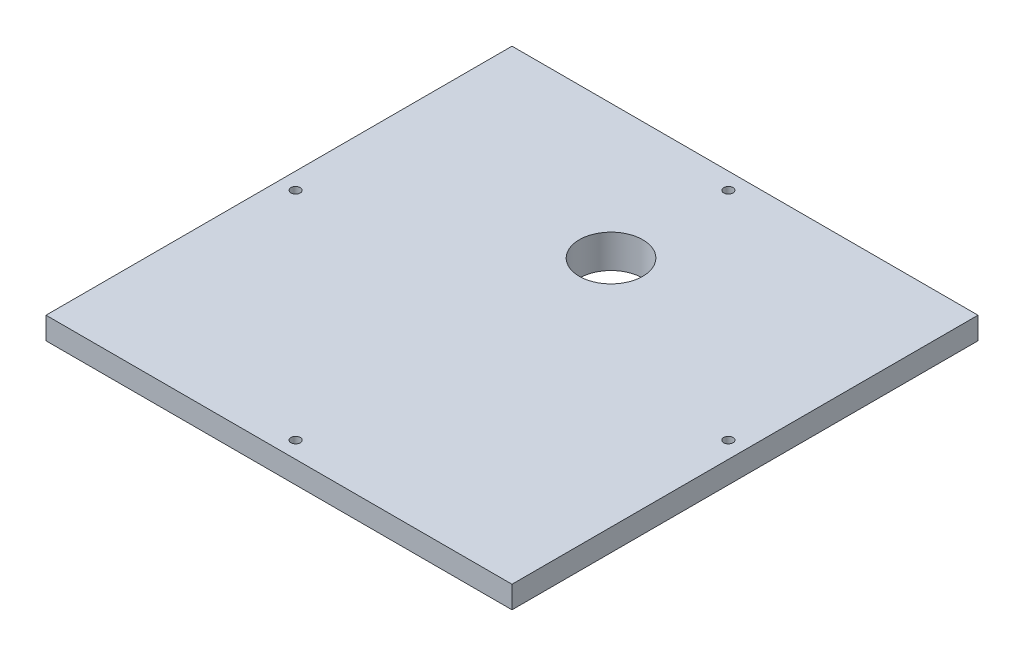
ISO-10303-21;
HEADER;
FILE_DESCRIPTION(('STEP AP214'),'2;1');
FILE_NAME('part.step','',(''),(''),'','','');
FILE_SCHEMA(('AUTOMOTIVE_DESIGN { 1 0 10303 214 1 1 1 1 }'));
ENDSEC;
DATA;
#1=APPLICATION_CONTEXT('core data for automotive mechanical design processes');
#2=APPLICATION_PROTOCOL_DEFINITION('international standard','automotive_design',2000,#1);
#3=PRODUCT_CONTEXT('',#1,'mechanical');
#4=PRODUCT('Part','Part','',(#3));
#5=PRODUCT_RELATED_PRODUCT_CATEGORY('part','',(#4));
#6=PRODUCT_DEFINITION_FORMATION('','',#4);
#7=PRODUCT_DEFINITION_CONTEXT('part definition',#1,'design');
#8=PRODUCT_DEFINITION('design','',#6,#7);
#9=PRODUCT_DEFINITION_SHAPE('','',#8);
#10=(LENGTH_UNIT() NAMED_UNIT(*) SI_UNIT(.MILLI.,.METRE.));
#11=(NAMED_UNIT(*) PLANE_ANGLE_UNIT() SI_UNIT($,.RADIAN.));
#12=(NAMED_UNIT(*) SI_UNIT($,.STERADIAN.) SOLID_ANGLE_UNIT());
#13=UNCERTAINTY_MEASURE_WITH_UNIT(LENGTH_MEASURE(1.E-05),#10,'distance_accuracy_value','');
#14=(GEOMETRIC_REPRESENTATION_CONTEXT(3) GLOBAL_UNCERTAINTY_ASSIGNED_CONTEXT((#13)) GLOBAL_UNIT_ASSIGNED_CONTEXT((#10,
#11,#12)) REPRESENTATION_CONTEXT('',''));
#15=CARTESIAN_POINT('',(0.,0.,0.));
#16=DIRECTION('',(0.,0.,1.));
#17=DIRECTION('',(1.,0.,0.));
#18=AXIS2_PLACEMENT_3D('',#15,#16,#17);
#19=CARTESIAN_POINT('',(0.,10.,0.));
#20=DIRECTION('',(0.,-1.,0.));
#21=DIRECTION('',(0.,0.,-1.));
#22=AXIS2_PLACEMENT_3D('',#19,#20,#21);
#23=PLANE('',#22);
#24=CARTESIAN_POINT('',(-97.5,10.,0.));
#25=DIRECTION('',(0.,1.,0.));
#26=DIRECTION('',(0.,0.,1.));
#27=AXIS2_PLACEMENT_3D('',#24,#25,#26);
#28=CIRCLE('',#27,2.1);
#29=CARTESIAN_POINT('',(-97.5,10.,2.1));
#30=VERTEX_POINT('',#29);
#31=EDGE_CURVE('E361',#30,#30,#28,.T.);
#32=ORIENTED_EDGE('',*,*,#31,.F.);
#33=EDGE_LOOP('',(#32));
#34=FACE_BOUND('',#33,.T.);
#35=CARTESIAN_POINT('',(0.,10.,97.5));
#36=DIRECTION('',(0.,1.,0.));
#37=DIRECTION('',(0.,0.,1.));
#38=AXIS2_PLACEMENT_3D('',#35,#36,#37);
#39=CIRCLE('',#38,2.1);
#40=CARTESIAN_POINT('',(0.,10.,99.6));
#41=VERTEX_POINT('',#40);
#42=EDGE_CURVE('E369',#41,#41,#39,.F.);
#43=ORIENTED_EDGE('',*,*,#42,.T.);
#44=EDGE_LOOP('',(#43));
#45=FACE_BOUND('',#44,.T.);
#46=CARTESIAN_POINT('',(97.5,10.,-8.88178419700125E-13));
#47=DIRECTION('',(0.,1.,0.));
#48=DIRECTION('',(0.,0.,1.));
#49=AXIS2_PLACEMENT_3D('',#46,#47,#48);
#50=CIRCLE('',#49,2.09999999999987);
#51=CARTESIAN_POINT('',(97.5,10.,2.09999999999899));
#52=VERTEX_POINT('',#51);
#53=EDGE_CURVE('E377',#52,#52,#50,.F.);
#54=ORIENTED_EDGE('',*,*,#53,.T.);
#55=EDGE_LOOP('',(#54));
#56=FACE_BOUND('',#55,.T.);
#57=CARTESIAN_POINT('',(0.,10.,-44.6253961525413));
#58=DIRECTION('',(0.,1.,0.));
#59=DIRECTION('',(0.,0.,1.));
#60=AXIS2_PLACEMENT_3D('',#57,#58,#59);
#61=CIRCLE('',#60,14.3);
#62=CARTESIAN_POINT('',(0.,10.,-30.3253961525413));
#63=VERTEX_POINT('',#62);
#64=EDGE_CURVE('E351',#63,#63,#61,.T.);
#65=ORIENTED_EDGE('',*,*,#64,.F.);
#66=EDGE_LOOP('',(#65));
#67=FACE_BOUND('',#66,.T.);
#68=DIRECTION('',(0.,0.,-1.));
#69=VECTOR('',#68,1.);
#70=CARTESIAN_POINT('',(105.,10.,105.));
#71=LINE('',#70,#69);
#72=CARTESIAN_POINT('',(105.,10.,105.));
#73=VERTEX_POINT('',#72);
#74=CARTESIAN_POINT('',(105.,10.,-105.));
#75=VERTEX_POINT('',#74);
#76=EDGE_CURVE('E146',#73,#75,#71,.T.);
#77=ORIENTED_EDGE('',*,*,#76,.T.);
#78=DIRECTION('',(-1.,0.,0.));
#79=VECTOR('',#78,1.);
#80=CARTESIAN_POINT('',(-105.,10.,-105.));
#81=LINE('',#80,#79);
#82=CARTESIAN_POINT('',(-105.,10.,-105.));
#83=VERTEX_POINT('',#82);
#84=EDGE_CURVE('E134',#75,#83,#81,.T.);
#85=ORIENTED_EDGE('',*,*,#84,.T.);
#86=DIRECTION('',(0.,0.,1.));
#87=VECTOR('',#86,1.);
#88=CARTESIAN_POINT('',(-105.,10.,105.));
#89=LINE('',#88,#87);
#90=CARTESIAN_POINT('',(-105.,10.,105.));
#91=VERTEX_POINT('',#90);
#92=EDGE_CURVE('E145',#83,#91,#89,.T.);
#93=ORIENTED_EDGE('',*,*,#92,.T.);
#94=DIRECTION('',(1.,0.,0.));
#95=VECTOR('',#94,1.);
#96=CARTESIAN_POINT('',(-105.,10.,105.));
#97=LINE('',#96,#95);
#98=EDGE_CURVE('E151',#91,#73,#97,.T.);
#99=ORIENTED_EDGE('',*,*,#98,.T.);
#100=EDGE_LOOP('',(#77,#85,#93,#99));
#101=FACE_BOUND('',#100,.T.);
#102=CARTESIAN_POINT('',(0.,10.,-97.5));
#103=DIRECTION('',(0.,1.,0.));
#104=DIRECTION('',(0.,0.,1.));
#105=AXIS2_PLACEMENT_3D('',#102,#103,#104);
#106=CIRCLE('',#105,2.1);
#107=CARTESIAN_POINT('',(0.,10.,-95.4));
#108=VERTEX_POINT('',#107);
#109=EDGE_CURVE('E345',#108,#108,#106,.T.);
#110=ORIENTED_EDGE('',*,*,#109,.F.);
#111=EDGE_LOOP('',(#110));
#112=FACE_BOUND('',#111,.T.);
#113=ADVANCED_FACE('F45',(#34,#45,#56,#67,#101,#112),#23,.F.);
#114=CARTESIAN_POINT('',(0.,0.,0.));
#115=DIRECTION('',(0.,-1.,0.));
#116=DIRECTION('',(0.,0.,-1.));
#117=AXIS2_PLACEMENT_3D('',#114,#115,#116);
#118=PLANE('',#117);
#119=CARTESIAN_POINT('',(0.,0.,97.5));
#120=DIRECTION('',(0.,-1.,0.));
#121=DIRECTION('',(0.,0.,-1.));
#122=AXIS2_PLACEMENT_3D('',#119,#120,#121);
#123=CIRCLE('',#122,2.1);
#124=CARTESIAN_POINT('',(0.,0.,95.4));
#125=VERTEX_POINT('',#124);
#126=EDGE_CURVE('E365',#125,#125,#123,.T.);
#127=ORIENTED_EDGE('',*,*,#126,.F.);
#128=EDGE_LOOP('',(#127));
#129=FACE_BOUND('',#128,.T.);
#130=CARTESIAN_POINT('',(97.5,0.,-8.88178419700125E-13));
#131=DIRECTION('',(0.,-1.,0.));
#132=DIRECTION('',(0.,0.,-1.));
#133=AXIS2_PLACEMENT_3D('',#130,#131,#132);
#134=CIRCLE('',#133,2.09999999999987);
#135=CARTESIAN_POINT('',(97.5,0.,-2.10000000000076));
#136=VERTEX_POINT('',#135);
#137=EDGE_CURVE('E373',#136,#136,#134,.T.);
#138=ORIENTED_EDGE('',*,*,#137,.F.);
#139=EDGE_LOOP('',(#138));
#140=FACE_BOUND('',#139,.T.);
#141=DIRECTION('',(0.,0.,1.));
#142=VECTOR('',#141,1.);
#143=CARTESIAN_POINT('',(89.8,0.,-89.8));
#144=LINE('',#143,#142);
#145=CARTESIAN_POINT('',(89.8,0.,-84.8030458649045));
#146=VERTEX_POINT('',#145);
#147=CARTESIAN_POINT('',(89.8,0.,84.8030458649045));
#148=VERTEX_POINT('',#147);
#149=EDGE_CURVE('E219',#146,#148,#144,.T.);
#150=ORIENTED_EDGE('',*,*,#149,.F.);
#151=CARTESIAN_POINT('',(84.7969522785059,0.,-84.7969522785059));
#152=DIRECTION('',(0.,-1.,0.));
#153=DIRECTION('',(0.707106781186548,0.,-0.707106781186548));
#154=AXIS2_PLACEMENT_3D('',#151,#152,#153);
#155=ELLIPSE('',#154,5.00609358752858,5.);
#156=CARTESIAN_POINT('',(84.8030458649045,0.,-89.8));
#157=VERTEX_POINT('',#156);
#158=EDGE_CURVE('E210',#146,#157,#155,.F.);
#159=ORIENTED_EDGE('',*,*,#158,.T.);
#160=DIRECTION('',(1.,0.,0.));
#161=VECTOR('',#160,1.);
#162=CARTESIAN_POINT('',(-89.8,0.,-89.8));
#163=LINE('',#162,#161);
#164=CARTESIAN_POINT('',(-84.8030458649045,0.,-89.8));
#165=VERTEX_POINT('',#164);
#166=EDGE_CURVE('E217',#165,#157,#163,.T.);
#167=ORIENTED_EDGE('',*,*,#166,.F.);
#168=CARTESIAN_POINT('',(-84.7969522785059,0.,-84.7969522785059));
#169=DIRECTION('',(0.,-1.,0.));
#170=DIRECTION('',(-0.707106781186548,0.,-0.707106781186548));
#171=AXIS2_PLACEMENT_3D('',#168,#169,#170);
#172=ELLIPSE('',#171,5.00609358752858,5.);
#173=CARTESIAN_POINT('',(-89.8,0.,-84.8030458649045));
#174=VERTEX_POINT('',#173);
#175=EDGE_CURVE('E54',#165,#174,#172,.F.);
#176=ORIENTED_EDGE('',*,*,#175,.T.);
#177=DIRECTION('',(0.,0.,-1.));
#178=VECTOR('',#177,1.);
#179=CARTESIAN_POINT('',(-89.8,0.,-89.8));
#180=LINE('',#179,#178);
#181=CARTESIAN_POINT('',(-89.8,0.,84.8030458649045));
#182=VERTEX_POINT('',#181);
#183=EDGE_CURVE('E230',#182,#174,#180,.T.);
#184=ORIENTED_EDGE('',*,*,#183,.F.);
#185=CARTESIAN_POINT('',(-84.7969522785059,0.,84.7969522785059));
#186=DIRECTION('',(0.,-1.,0.));
#187=DIRECTION('',(-0.707106781186548,0.,0.707106781186548));
#188=AXIS2_PLACEMENT_3D('',#185,#186,#187);
#189=ELLIPSE('',#188,5.00609358752858,5.);
#190=CARTESIAN_POINT('',(-84.8030458649045,0.,89.8));
#191=VERTEX_POINT('',#190);
#192=EDGE_CURVE('E11',#182,#191,#189,.F.);
#193=ORIENTED_EDGE('',*,*,#192,.T.);
#194=DIRECTION('',(-1.,0.,0.));
#195=VECTOR('',#194,1.);
#196=CARTESIAN_POINT('',(-89.8,0.,89.8));
#197=LINE('',#196,#195);
#198=CARTESIAN_POINT('',(84.8030458649045,0.,89.8));
#199=VERTEX_POINT('',#198);
#200=EDGE_CURVE('E389',#199,#191,#197,.T.);
#201=ORIENTED_EDGE('',*,*,#200,.F.);
#202=CARTESIAN_POINT('',(84.7969522785059,0.,84.7969522785059));
#203=DIRECTION('',(0.,-1.,0.));
#204=DIRECTION('',(0.707106781186548,0.,0.707106781186548));
#205=AXIS2_PLACEMENT_3D('',#202,#203,#204);
#206=ELLIPSE('',#205,5.00609358752858,5.);
#207=EDGE_CURVE('E207',#199,#148,#206,.F.);
#208=ORIENTED_EDGE('',*,*,#207,.T.);
#209=EDGE_LOOP('',(#150,#159,#167,#176,#184,#193,#201,#208));
#210=FACE_BOUND('',#209,.T.);
#211=DIRECTION('',(0.,0.,-1.));
#212=VECTOR('',#211,1.);
#213=CARTESIAN_POINT('',(105.,0.,105.));
#214=LINE('',#213,#212);
#215=CARTESIAN_POINT('',(105.,0.,105.));
#216=VERTEX_POINT('',#215);
#217=CARTESIAN_POINT('',(105.,0.,-105.));
#218=VERTEX_POINT('',#217);
#219=EDGE_CURVE('E160',#216,#218,#214,.T.);
#220=ORIENTED_EDGE('',*,*,#219,.F.);
#221=DIRECTION('',(1.,0.,0.));
#222=VECTOR('',#221,1.);
#223=CARTESIAN_POINT('',(-105.,0.,105.));
#224=LINE('',#223,#222);
#225=CARTESIAN_POINT('',(-105.,0.,105.));
#226=VERTEX_POINT('',#225);
#227=EDGE_CURVE('E156',#226,#216,#224,.T.);
#228=ORIENTED_EDGE('',*,*,#227,.F.);
#229=DIRECTION('',(0.,0.,1.));
#230=VECTOR('',#229,1.);
#231=CARTESIAN_POINT('',(-105.,0.,105.));
#232=LINE('',#231,#230);
#233=CARTESIAN_POINT('',(-105.,0.,-105.));
#234=VERTEX_POINT('',#233);
#235=EDGE_CURVE('E267',#234,#226,#232,.T.);
#236=ORIENTED_EDGE('',*,*,#235,.F.);
#237=DIRECTION('',(-1.,0.,0.));
#238=VECTOR('',#237,1.);
#239=CARTESIAN_POINT('',(-105.,0.,-105.));
#240=LINE('',#239,#238);
#241=EDGE_CURVE('E264',#218,#234,#240,.T.);
#242=ORIENTED_EDGE('',*,*,#241,.F.);
#243=EDGE_LOOP('',(#220,#228,#236,#242));
#244=FACE_BOUND('',#243,.T.);
#245=CARTESIAN_POINT('',(-97.5,0.,0.));
#246=DIRECTION('',(0.,-1.,0.));
#247=DIRECTION('',(0.,0.,-1.));
#248=AXIS2_PLACEMENT_3D('',#245,#246,#247);
#249=CIRCLE('',#248,2.1);
#250=CARTESIAN_POINT('',(-97.5,0.,-2.1));
#251=VERTEX_POINT('',#250);
#252=EDGE_CURVE('E358',#251,#251,#249,.F.);
#253=ORIENTED_EDGE('',*,*,#252,.T.);
#254=EDGE_LOOP('',(#253));
#255=FACE_BOUND('',#254,.T.);
#256=CARTESIAN_POINT('',(0.,0.,-97.5));
#257=DIRECTION('',(0.,-1.,0.));
#258=DIRECTION('',(0.,0.,-1.));
#259=AXIS2_PLACEMENT_3D('',#256,#257,#258);
#260=CIRCLE('',#259,2.1);
#261=CARTESIAN_POINT('',(0.,0.,-99.6));
#262=VERTEX_POINT('',#261);
#263=EDGE_CURVE('E348',#262,#262,#260,.F.);
#264=ORIENTED_EDGE('',*,*,#263,.T.);
#265=EDGE_LOOP('',(#264));
#266=FACE_BOUND('',#265,.T.);
#267=ADVANCED_FACE('F215',(#129,#140,#210,#244,#255,#266),#118,.T.);
#268=CARTESIAN_POINT('',(105.,10.,105.));
#269=DIRECTION('',(-1.,0.,0.));
#270=DIRECTION('',(0.,0.,1.));
#271=AXIS2_PLACEMENT_3D('',#268,#269,#270);
#272=PLANE('',#271);
#273=ORIENTED_EDGE('',*,*,#219,.T.);
#274=DIRECTION('',(0.,-1.,0.));
#275=VECTOR('',#274,1.);
#276=CARTESIAN_POINT('',(105.,10.,-105.));
#277=LINE('',#276,#275);
#278=EDGE_CURVE('E138',#75,#218,#277,.T.);
#279=ORIENTED_EDGE('',*,*,#278,.F.);
#280=ORIENTED_EDGE('',*,*,#76,.F.);
#281=DIRECTION('',(0.,-1.,0.));
#282=VECTOR('',#281,1.);
#283=CARTESIAN_POINT('',(105.,10.,105.));
#284=LINE('',#283,#282);
#285=EDGE_CURVE('E261',#73,#216,#284,.T.);
#286=ORIENTED_EDGE('',*,*,#285,.T.);
#287=EDGE_LOOP('',(#273,#279,#280,#286));
#288=FACE_BOUND('',#287,.T.);
#289=ADVANCED_FACE('F158',(#288),#272,.F.);
#290=CARTESIAN_POINT('',(-105.,10.,-105.));
#291=DIRECTION('',(0.,0.,1.));
#292=DIRECTION('',(1.,0.,0.));
#293=AXIS2_PLACEMENT_3D('',#290,#291,#292);
#294=PLANE('',#293);
#295=ORIENTED_EDGE('',*,*,#241,.T.);
#296=DIRECTION('',(0.,-1.,0.));
#297=VECTOR('',#296,1.);
#298=CARTESIAN_POINT('',(-105.,10.,-105.));
#299=LINE('',#298,#297);
#300=EDGE_CURVE('E141',#83,#234,#299,.T.);
#301=ORIENTED_EDGE('',*,*,#300,.F.);
#302=ORIENTED_EDGE('',*,*,#84,.F.);
#303=ORIENTED_EDGE('',*,*,#278,.T.);
#304=EDGE_LOOP('',(#295,#301,#302,#303));
#305=FACE_BOUND('',#304,.T.);
#306=ADVANCED_FACE('F136',(#305),#294,.F.);
#307=CARTESIAN_POINT('',(-105.,10.,105.));
#308=DIRECTION('',(1.,0.,0.));
#309=DIRECTION('',(0.,0.,-1.));
#310=AXIS2_PLACEMENT_3D('',#307,#308,#309);
#311=PLANE('',#310);
#312=ORIENTED_EDGE('',*,*,#235,.T.);
#313=DIRECTION('',(0.,-1.,0.));
#314=VECTOR('',#313,1.);
#315=CARTESIAN_POINT('',(-105.,10.,105.));
#316=LINE('',#315,#314);
#317=EDGE_CURVE('E168',#91,#226,#316,.T.);
#318=ORIENTED_EDGE('',*,*,#317,.F.);
#319=ORIENTED_EDGE('',*,*,#92,.F.);
#320=ORIENTED_EDGE('',*,*,#300,.T.);
#321=EDGE_LOOP('',(#312,#318,#319,#320));
#322=FACE_BOUND('',#321,.T.);
#323=ADVANCED_FACE('F282',(#322),#311,.F.);
#324=CARTESIAN_POINT('',(-105.,10.,105.));
#325=DIRECTION('',(0.,0.,-1.));
#326=DIRECTION('',(-1.,0.,0.));
#327=AXIS2_PLACEMENT_3D('',#324,#325,#326);
#328=PLANE('',#327);
#329=ORIENTED_EDGE('',*,*,#227,.T.);
#330=ORIENTED_EDGE('',*,*,#285,.F.);
#331=ORIENTED_EDGE('',*,*,#98,.F.);
#332=ORIENTED_EDGE('',*,*,#317,.T.);
#333=EDGE_LOOP('',(#329,#330,#331,#332));
#334=FACE_BOUND('',#333,.T.);
#335=ADVANCED_FACE('F278',(#334),#328,.F.);
#336=CARTESIAN_POINT('',(89.8,0.,-89.8));
#337=DIRECTION('',(0.999390827019096,-0.034899496702501,0.));
#338=DIRECTION('',(0.034899496702501,0.999390827019096,0.));
#339=AXIS2_PLACEMENT_3D('',#336,#337,#338);
#340=PLANE('',#339);
#341=ORIENTED_EDGE('',*,*,#149,.T.);
#342=DIRECTION('',(-0.0348782627423747,-0.998782765958718,-0.0348782627423747));
#343=VECTOR('',#342,1.);
#344=CARTESIAN_POINT('',(89.5875965799237,-6.08243813546191,84.5906424448282));
#345=LINE('',#344,#343);
#346=CARTESIAN_POINT('',(89.6253961525413,-5.,84.6284420174457));
#347=VERTEX_POINT('',#346);
#348=EDGE_CURVE('E179',#148,#347,#345,.T.);
#349=ORIENTED_EDGE('',*,*,#348,.T.);
#350=DIRECTION('',(0.,0.,-1.));
#351=VECTOR('',#350,1.);
#352=CARTESIAN_POINT('',(89.6253961525413,-5.,0.));
#353=LINE('',#352,#351);
#354=CARTESIAN_POINT('',(89.6253961525413,-5.,-84.6284420174457));
#355=VERTEX_POINT('',#354);
#356=EDGE_CURVE('E229',#355,#347,#353,.F.);
#357=ORIENTED_EDGE('',*,*,#356,.F.);
#358=DIRECTION('',(-0.0348782627423747,-0.998782765958718,0.0348782627423747));
#359=VECTOR('',#358,1.);
#360=CARTESIAN_POINT('',(89.8060787607856,0.174072933504123,-84.8091246256902));
#361=LINE('',#360,#359);
#362=EDGE_CURVE('E175',#355,#146,#361,.F.);
#363=ORIENTED_EDGE('',*,*,#362,.T.);
#364=EDGE_LOOP('',(#341,#349,#357,#363));
#365=FACE_BOUND('',#364,.T.);
#366=ADVANCED_FACE('F241',(#365),#340,.T.);
#367=CARTESIAN_POINT('',(-89.8,0.,89.8));
#368=DIRECTION('',(0.,-0.034899496702501,0.999390827019096));
#369=DIRECTION('',(0.,-0.999390827019096,-0.034899496702501));
#370=AXIS2_PLACEMENT_3D('',#367,#368,#369);
#371=PLANE('',#370);
#372=DIRECTION('',(1.,0.,0.));
#373=VECTOR('',#372,1.);
#374=CARTESIAN_POINT('',(0.,-5.,89.6253961525413));
#375=LINE('',#374,#373);
#376=CARTESIAN_POINT('',(84.6284420174457,-5.,89.6253961525413));
#377=VERTEX_POINT('',#376);
#378=CARTESIAN_POINT('',(-84.6284420174457,-5.,89.6253961525413));
#379=VERTEX_POINT('',#378);
#380=EDGE_CURVE('E244',#377,#379,#375,.F.);
#381=ORIENTED_EDGE('',*,*,#380,.F.);
#382=DIRECTION('',(-0.0348782627423747,-0.998782765958718,-0.0348782627423747));
#383=VECTOR('',#382,1.);
#384=CARTESIAN_POINT('',(84.5906424448282,-6.08243813546191,89.5875965799237));
#385=LINE('',#384,#383);
#386=EDGE_CURVE('E166',#377,#199,#385,.F.);
#387=ORIENTED_EDGE('',*,*,#386,.T.);
#388=ORIENTED_EDGE('',*,*,#200,.T.);
#389=DIRECTION('',(0.0348782627423747,-0.998782765958718,-0.0348782627423747));
#390=VECTOR('',#389,1.);
#391=CARTESIAN_POINT('',(-84.8091246256902,0.174072933504123,89.8060787607856));
#392=LINE('',#391,#390);
#393=EDGE_CURVE('E162',#191,#379,#392,.T.);
#394=ORIENTED_EDGE('',*,*,#393,.T.);
#395=EDGE_LOOP('',(#381,#387,#388,#394));
#396=FACE_BOUND('',#395,.T.);
#397=ADVANCED_FACE('F304',(#396),#371,.T.);
#398=CARTESIAN_POINT('',(-89.8,0.,-89.8));
#399=DIRECTION('',(-0.999390827019096,-0.034899496702501,0.));
#400=DIRECTION('',(0.034899496702501,-0.999390827019096,0.));
#401=AXIS2_PLACEMENT_3D('',#398,#399,#400);
#402=PLANE('',#401);
#403=ORIENTED_EDGE('',*,*,#183,.T.);
#404=DIRECTION('',(0.0348782627423747,-0.998782765958718,0.0348782627423747));
#405=VECTOR('',#404,1.);
#406=CARTESIAN_POINT('',(-89.8060787607856,0.174072933504123,-84.8091246256902));
#407=LINE('',#406,#405);
#408=CARTESIAN_POINT('',(-89.6253961525413,-5.,-84.6284420174457));
#409=VERTEX_POINT('',#408);
#410=EDGE_CURVE('E204',#174,#409,#407,.T.);
#411=ORIENTED_EDGE('',*,*,#410,.T.);
#412=DIRECTION('',(0.,0.,1.));
#413=VECTOR('',#412,1.);
#414=CARTESIAN_POINT('',(-89.6253961525413,-5.,0.));
#415=LINE('',#414,#413);
#416=CARTESIAN_POINT('',(-89.6253961525413,-5.,84.6284420174457));
#417=VERTEX_POINT('',#416);
#418=EDGE_CURVE('E248',#417,#409,#415,.F.);
#419=ORIENTED_EDGE('',*,*,#418,.F.);
#420=DIRECTION('',(0.0348782627423747,-0.998782765958718,-0.0348782627423747));
#421=VECTOR('',#420,1.);
#422=CARTESIAN_POINT('',(-89.5875965799237,-6.08243813546191,84.5906424448282));
#423=LINE('',#422,#421);
#424=EDGE_CURVE('E201',#417,#182,#423,.F.);
#425=ORIENTED_EDGE('',*,*,#424,.T.);
#426=EDGE_LOOP('',(#403,#411,#419,#425));
#427=FACE_BOUND('',#426,.T.);
#428=ADVANCED_FACE('F307',(#427),#402,.T.);
#429=CARTESIAN_POINT('',(-89.8,0.,-89.8));
#430=DIRECTION('',(0.,-0.034899496702501,-0.999390827019096));
#431=DIRECTION('',(0.,0.999390827019096,-0.034899496702501));
#432=AXIS2_PLACEMENT_3D('',#429,#430,#431);
#433=PLANE('',#432);
#434=ORIENTED_EDGE('',*,*,#166,.T.);
#435=DIRECTION('',(-0.0348782627423747,-0.998782765958718,0.0348782627423747));
#436=VECTOR('',#435,1.);
#437=CARTESIAN_POINT('',(84.5906424448282,-6.08243813546191,-89.5875965799237));
#438=LINE('',#437,#436);
#439=CARTESIAN_POINT('',(84.6284420174457,-5.,-89.6253961525413));
#440=VERTEX_POINT('',#439);
#441=EDGE_CURVE('E198',#157,#440,#438,.T.);
#442=ORIENTED_EDGE('',*,*,#441,.T.);
#443=DIRECTION('',(-1.,0.,0.));
#444=VECTOR('',#443,1.);
#445=CARTESIAN_POINT('',(0.,-5.,-89.6253961525413));
#446=LINE('',#445,#444);
#447=CARTESIAN_POINT('',(-84.6284420174457,-5.,-89.6253961525413));
#448=VERTEX_POINT('',#447);
#449=EDGE_CURVE('E239',#448,#440,#446,.F.);
#450=ORIENTED_EDGE('',*,*,#449,.F.);
#451=DIRECTION('',(0.0348782627423747,-0.998782765958718,0.0348782627423747));
#452=VECTOR('',#451,1.);
#453=CARTESIAN_POINT('',(-84.8091246256902,0.174072933504123,-89.8060787607856));
#454=LINE('',#453,#452);
#455=EDGE_CURVE('E194',#448,#165,#454,.F.);
#456=ORIENTED_EDGE('',*,*,#455,.T.);
#457=EDGE_LOOP('',(#434,#442,#450,#456));
#458=FACE_BOUND('',#457,.T.);
#459=ADVANCED_FACE('F224',(#458),#433,.T.);
#460=CARTESIAN_POINT('',(0.,-5.,0.));
#461=DIRECTION('',(0.,1.,0.));
#462=DIRECTION('',(0.,0.,1.));
#463=AXIS2_PLACEMENT_3D('',#460,#461,#462);
#464=PLANE('',#463);
#465=CARTESIAN_POINT('',(0.,-5.,-44.6253961525413));
#466=DIRECTION('',(0.,1.,0.));
#467=DIRECTION('',(0.,0.,1.));
#468=AXIS2_PLACEMENT_3D('',#465,#466,#467);
#469=CIRCLE('',#468,14.3);
#470=CARTESIAN_POINT('',(0.,-5.,-30.3253961525413));
#471=VERTEX_POINT('',#470);
#472=EDGE_CURVE('E356',#471,#471,#469,.F.);
#473=ORIENTED_EDGE('',*,*,#472,.F.);
#474=EDGE_LOOP('',(#473));
#475=FACE_BOUND('',#474,.T.);
#476=ORIENTED_EDGE('',*,*,#356,.T.);
#477=CARTESIAN_POINT('',(84.6223484310471,-5.,84.6223484310472));
#478=DIRECTION('',(0.,1.,0.));
#479=DIRECTION('',(0.707106781186548,0.,0.707106781186548));
#480=AXIS2_PLACEMENT_3D('',#477,#478,#479);
#481=ELLIPSE('',#480,5.00609358752858,5.);
#482=EDGE_CURVE('E191',#347,#377,#481,.F.);
#483=ORIENTED_EDGE('',*,*,#482,.T.);
#484=ORIENTED_EDGE('',*,*,#380,.T.);
#485=CARTESIAN_POINT('',(-84.6223484310472,-5.,84.6223484310471));
#486=DIRECTION('',(0.,1.,0.));
#487=DIRECTION('',(-0.707106781186548,0.,0.707106781186548));
#488=AXIS2_PLACEMENT_3D('',#485,#486,#487);
#489=ELLIPSE('',#488,5.00609358752858,5.);
#490=EDGE_CURVE('E182',#379,#417,#489,.F.);
#491=ORIENTED_EDGE('',*,*,#490,.T.);
#492=ORIENTED_EDGE('',*,*,#418,.T.);
#493=CARTESIAN_POINT('',(-84.6223484310471,-5.,-84.6223484310471));
#494=DIRECTION('',(0.,1.,0.));
#495=DIRECTION('',(-0.707106781186548,0.,-0.707106781186548));
#496=AXIS2_PLACEMENT_3D('',#493,#494,#495);
#497=ELLIPSE('',#496,5.00609358752858,5.);
#498=EDGE_CURVE('E185',#409,#448,#497,.F.);
#499=ORIENTED_EDGE('',*,*,#498,.T.);
#500=ORIENTED_EDGE('',*,*,#449,.T.);
#501=CARTESIAN_POINT('',(84.6223484310471,-5.,-84.6223484310471));
#502=DIRECTION('',(0.,1.,0.));
#503=DIRECTION('',(0.707106781186548,0.,-0.707106781186548));
#504=AXIS2_PLACEMENT_3D('',#501,#502,#503);
#505=ELLIPSE('',#504,5.00609358752858,5.);
#506=EDGE_CURVE('E188',#440,#355,#505,.F.);
#507=ORIENTED_EDGE('',*,*,#506,.T.);
#508=EDGE_LOOP('',(#476,#483,#484,#491,#492,#499,#500,#507));
#509=FACE_BOUND('',#508,.T.);
#510=ADVANCED_FACE('F237',(#475,#509),#464,.F.);
#511=CARTESIAN_POINT('',(0.,-45.4465078838705,-44.6253961525413));
#512=DIRECTION('',(0.,1.,0.));
#513=DIRECTION('',(0.,0.,1.));
#514=AXIS2_PLACEMENT_3D('',#511,#512,#513);
#515=CYLINDRICAL_SURFACE('',#514,14.3);
#516=ORIENTED_EDGE('',*,*,#472,.T.);
#517=EDGE_LOOP('',(#516));
#518=FACE_BOUND('',#517,.T.);
#519=ORIENTED_EDGE('',*,*,#64,.T.);
#520=EDGE_LOOP('',(#519));
#521=FACE_BOUND('',#520,.T.);
#522=ADVANCED_FACE('F318',(#518,#521),#515,.F.);
#523=CARTESIAN_POINT('',(97.5,-5.93969696196701,-8.88178419700125E-13));
#524=DIRECTION('',(0.,1.,0.));
#525=DIRECTION('',(0.,0.,1.));
#526=AXIS2_PLACEMENT_3D('',#523,#524,#525);
#527=CYLINDRICAL_SURFACE('',#526,2.09999999999987);
#528=ORIENTED_EDGE('',*,*,#53,.F.);
#529=EDGE_LOOP('',(#528));
#530=FACE_BOUND('',#529,.T.);
#531=ORIENTED_EDGE('',*,*,#137,.T.);
#532=EDGE_LOOP('',(#531));
#533=FACE_BOUND('',#532,.T.);
#534=ADVANCED_FACE('F321',(#530,#533),#527,.F.);
#535=CARTESIAN_POINT('',(0.,-5.93969696196701,97.5));
#536=DIRECTION('',(0.,1.,0.));
#537=DIRECTION('',(0.,0.,1.));
#538=AXIS2_PLACEMENT_3D('',#535,#536,#537);
#539=CYLINDRICAL_SURFACE('',#538,2.1);
#540=ORIENTED_EDGE('',*,*,#42,.F.);
#541=EDGE_LOOP('',(#540));
#542=FACE_BOUND('',#541,.T.);
#543=ORIENTED_EDGE('',*,*,#126,.T.);
#544=EDGE_LOOP('',(#543));
#545=FACE_BOUND('',#544,.T.);
#546=ADVANCED_FACE('F324',(#542,#545),#539,.F.);
#547=CARTESIAN_POINT('',(-97.5,-5.93969696196701,0.));
#548=DIRECTION('',(0.,1.,0.));
#549=DIRECTION('',(0.,0.,1.));
#550=AXIS2_PLACEMENT_3D('',#547,#548,#549);
#551=CYLINDRICAL_SURFACE('',#550,2.1);
#552=ORIENTED_EDGE('',*,*,#31,.T.);
#553=EDGE_LOOP('',(#552));
#554=FACE_BOUND('',#553,.T.);
#555=ORIENTED_EDGE('',*,*,#252,.F.);
#556=EDGE_LOOP('',(#555));
#557=FACE_BOUND('',#556,.T.);
#558=ADVANCED_FACE('F328',(#554,#557),#551,.F.);
#559=CARTESIAN_POINT('',(0.,-5.93969696196701,-97.5));
#560=DIRECTION('',(0.,1.,0.));
#561=DIRECTION('',(0.,0.,1.));
#562=AXIS2_PLACEMENT_3D('',#559,#560,#561);
#563=CYLINDRICAL_SURFACE('',#562,2.1);
#564=ORIENTED_EDGE('',*,*,#109,.T.);
#565=EDGE_LOOP('',(#564));
#566=FACE_BOUND('',#565,.T.);
#567=ORIENTED_EDGE('',*,*,#263,.F.);
#568=EDGE_LOOP('',(#567));
#569=FACE_BOUND('',#568,.T.);
#570=ADVANCED_FACE('F332',(#566,#569),#563,.F.);
#571=CARTESIAN_POINT('',(84.5906424448282,-5.9079406519494,84.5906424448282));
#572=DIRECTION('',(0.0348782627423747,0.998782765958718,0.0348782627423747));
#573=DIRECTION('',(0.,-0.034899496702501,0.999390827019096));
#574=AXIS2_PLACEMENT_3D('',#571,#572,#573);
#575=CYLINDRICAL_SURFACE('',#574,5.);
#576=ORIENTED_EDGE('',*,*,#482,.F.);
#577=ORIENTED_EDGE('',*,*,#348,.F.);
#578=ORIENTED_EDGE('',*,*,#207,.F.);
#579=ORIENTED_EDGE('',*,*,#386,.F.);
#580=EDGE_LOOP('',(#576,#577,#578,#579));
#581=FACE_BOUND('',#580,.T.);
#582=ADVANCED_FACE('F335',(#581),#575,.T.);
#583=CARTESIAN_POINT('',(84.8091246256902,0.348570417016628,-84.8091246256902));
#584=DIRECTION('',(0.0348782627423747,0.998782765958718,-0.0348782627423747));
#585=DIRECTION('',(0.,0.034899496702501,0.999390827019096));
#586=AXIS2_PLACEMENT_3D('',#583,#584,#585);
#587=CYLINDRICAL_SURFACE('',#586,5.);
#588=ORIENTED_EDGE('',*,*,#506,.F.);
#589=ORIENTED_EDGE('',*,*,#441,.F.);
#590=ORIENTED_EDGE('',*,*,#158,.F.);
#591=ORIENTED_EDGE('',*,*,#362,.F.);
#592=EDGE_LOOP('',(#588,#589,#590,#591));
#593=FACE_BOUND('',#592,.T.);
#594=ADVANCED_FACE('F233',(#593),#587,.T.);
#595=CARTESIAN_POINT('',(-84.8091246256902,0.348570417016628,-84.8091246256902));
#596=DIRECTION('',(-0.0348782627423747,0.998782765958718,-0.0348782627423747));
#597=DIRECTION('',(0.,0.034899496702501,0.999390827019096));
#598=AXIS2_PLACEMENT_3D('',#595,#596,#597);
#599=CYLINDRICAL_SURFACE('',#598,5.);
#600=ORIENTED_EDGE('',*,*,#498,.F.);
#601=ORIENTED_EDGE('',*,*,#410,.F.);
#602=ORIENTED_EDGE('',*,*,#175,.F.);
#603=ORIENTED_EDGE('',*,*,#455,.F.);
#604=EDGE_LOOP('',(#600,#601,#602,#603));
#605=FACE_BOUND('',#604,.T.);
#606=ADVANCED_FACE('F397',(#605),#599,.T.);
#607=CARTESIAN_POINT('',(-84.5906424448282,-5.9079406519494,84.5906424448282));
#608=DIRECTION('',(-0.0348782627423747,0.998782765958718,0.0348782627423747));
#609=DIRECTION('',(0.,-0.034899496702501,0.999390827019096));
#610=AXIS2_PLACEMENT_3D('',#607,#608,#609);
#611=CYLINDRICAL_SURFACE('',#610,5.);
#612=ORIENTED_EDGE('',*,*,#490,.F.);
#613=ORIENTED_EDGE('',*,*,#393,.F.);
#614=ORIENTED_EDGE('',*,*,#192,.F.);
#615=ORIENTED_EDGE('',*,*,#424,.F.);
#616=EDGE_LOOP('',(#612,#613,#614,#615));
#617=FACE_BOUND('',#616,.T.);
#618=ADVANCED_FACE('F47',(#617),#611,.T.);
#619=CLOSED_SHELL('',(#113,#267,#289,#306,#323,#335,#366,#397,#428,#459,#510,#522,#534,#546,
#558,#570,#582,#594,#606,#618));
#620=MANIFOLD_SOLID_BREP('B2',#619);
#621=ADVANCED_BREP_SHAPE_REPRESENTATION('',(#18,#620),#14);
#622=SHAPE_DEFINITION_REPRESENTATION(#9,#621);
ENDSEC;
END-ISO-10303-21;
